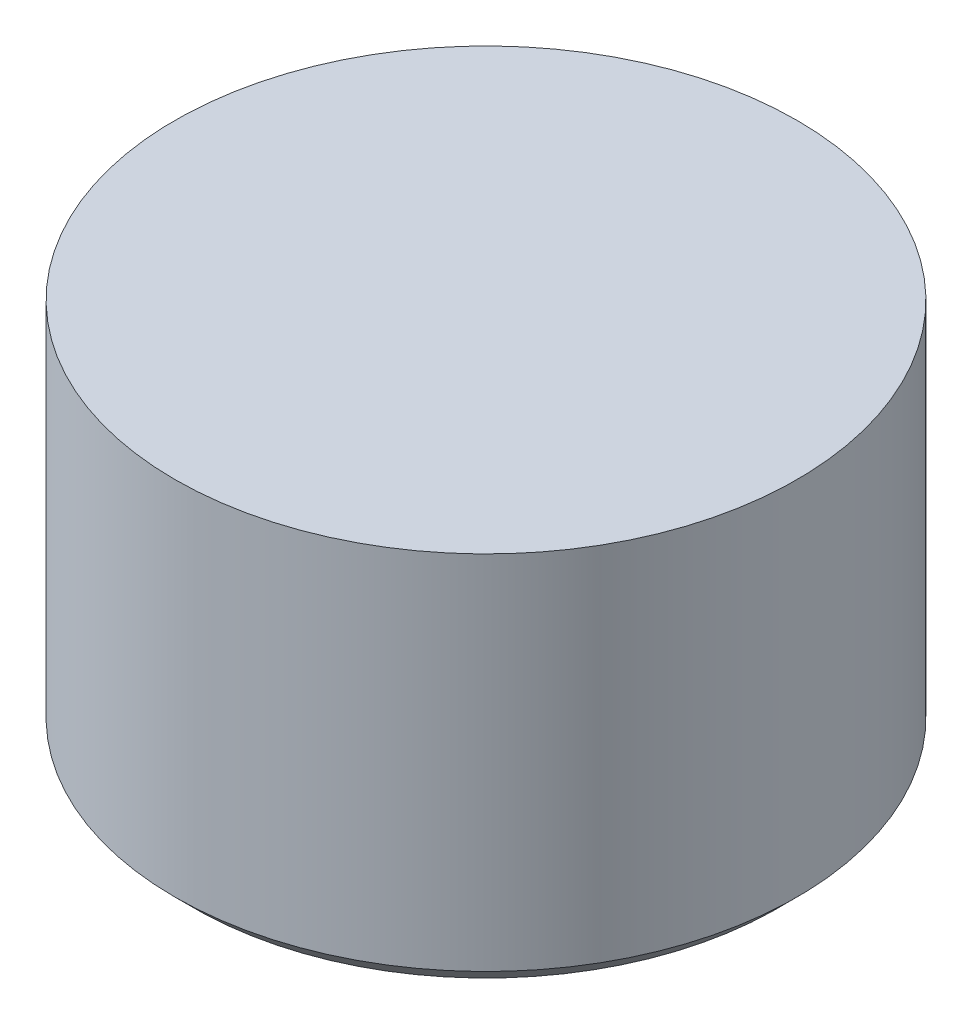
ISO-10303-21;
HEADER;
FILE_DESCRIPTION(('STEP AP214'),'2;1');
FILE_NAME('part.step','',(''),(''),'','','');
FILE_SCHEMA(('AUTOMOTIVE_DESIGN { 1 0 10303 214 1 1 1 1 }'));
ENDSEC;
DATA;
#1=APPLICATION_CONTEXT('core data for automotive mechanical design processes');
#2=APPLICATION_PROTOCOL_DEFINITION('international standard','automotive_design',2000,#1);
#3=PRODUCT_CONTEXT('',#1,'mechanical');
#4=PRODUCT('Part','Part','',(#3));
#5=PRODUCT_RELATED_PRODUCT_CATEGORY('part','',(#4));
#6=PRODUCT_DEFINITION_FORMATION('','',#4);
#7=PRODUCT_DEFINITION_CONTEXT('part definition',#1,'design');
#8=PRODUCT_DEFINITION('design','',#6,#7);
#9=PRODUCT_DEFINITION_SHAPE('','',#8);
#10=(LENGTH_UNIT() NAMED_UNIT(*) SI_UNIT(.MILLI.,.METRE.));
#11=(NAMED_UNIT(*) PLANE_ANGLE_UNIT() SI_UNIT($,.RADIAN.));
#12=(NAMED_UNIT(*) SI_UNIT($,.STERADIAN.) SOLID_ANGLE_UNIT());
#13=UNCERTAINTY_MEASURE_WITH_UNIT(LENGTH_MEASURE(1.E-05),#10,'distance_accuracy_value','');
#14=(GEOMETRIC_REPRESENTATION_CONTEXT(3) GLOBAL_UNCERTAINTY_ASSIGNED_CONTEXT((#13)) GLOBAL_UNIT_ASSIGNED_CONTEXT((#10,
#11,#12)) REPRESENTATION_CONTEXT('',''));
#15=CARTESIAN_POINT('',(0.,0.,0.));
#16=DIRECTION('',(0.,0.,1.));
#17=DIRECTION('',(1.,0.,0.));
#18=AXIS2_PLACEMENT_3D('',#15,#16,#17);
#19=CARTESIAN_POINT('',(-4.92125,-9.238275296126,-7.55));
#20=DIRECTION('',(0.,-1.,0.));
#21=DIRECTION('',(-1.,0.,0.));
#22=AXIS2_PLACEMENT_3D('',#19,#20,#21);
#23=PLANE('',#22);
#24=DIRECTION('',(-0.866025403784439,0.,0.5));
#25=VECTOR('',#24,1.);
#26=CARTESIAN_POINT('',(1.0414,-9.23827529612599,-6.94874742966592));
#27=LINE('',#26,#25);
#28=CARTESIAN_POINT('',(1.0414,-9.23827529612599,-6.94874742966592));
#29=VERTEX_POINT('',#28);
#30=CARTESIAN_POINT('',(0.,-9.238275296126,-6.34749485933185));
#31=VERTEX_POINT('',#30);
#32=EDGE_CURVE('E154',#29,#31,#27,.T.);
#33=ORIENTED_EDGE('',*,*,#32,.T.);
#34=DIRECTION('',(-0.866025403784438,0.,-0.5));
#35=VECTOR('',#34,1.);
#36=CARTESIAN_POINT('',(0.,-9.238275296126,-6.34749485933185));
#37=LINE('',#36,#35);
#38=CARTESIAN_POINT('',(-1.0414,-9.23827529612599,-6.94874742966593));
#39=VERTEX_POINT('',#38);
#40=EDGE_CURVE('E11',#31,#39,#37,.T.);
#41=ORIENTED_EDGE('',*,*,#40,.T.);
#42=DIRECTION('',(0.,0.,-1.));
#43=VECTOR('',#42,1.);
#44=CARTESIAN_POINT('',(-1.0414,-9.23827529612599,-6.94874742966593));
#45=LINE('',#44,#43);
#46=CARTESIAN_POINT('',(-1.0414,-9.238275296126,-8.15125257033408));
#47=VERTEX_POINT('',#46);
#48=EDGE_CURVE('E42',#39,#47,#45,.T.);
#49=ORIENTED_EDGE('',*,*,#48,.T.);
#50=DIRECTION('',(0.866025403784439,0.,-0.5));
#51=VECTOR('',#50,1.);
#52=CARTESIAN_POINT('',(-1.0414,-9.238275296126,-8.15125257033408));
#53=LINE('',#52,#51);
#54=CARTESIAN_POINT('',(0.,-9.238275296126,-8.75250514066815));
#55=VERTEX_POINT('',#54);
#56=EDGE_CURVE('E108',#47,#55,#53,.T.);
#57=ORIENTED_EDGE('',*,*,#56,.T.);
#58=DIRECTION('',(0.866025403784438,0.,0.5));
#59=VECTOR('',#58,1.);
#60=CARTESIAN_POINT('',(0.,-9.238275296126,-8.75250514066815));
#61=LINE('',#60,#59);
#62=CARTESIAN_POINT('',(1.0414,-9.238275296126,-8.15125257033408));
#63=VERTEX_POINT('',#62);
#64=EDGE_CURVE('E164',#55,#63,#61,.T.);
#65=ORIENTED_EDGE('',*,*,#64,.T.);
#66=DIRECTION('',(0.,0.,1.));
#67=VECTOR('',#66,1.);
#68=CARTESIAN_POINT('',(1.0414,-9.238275296126,-8.15125257033408));
#69=LINE('',#68,#67);
#70=EDGE_CURVE('E158',#63,#29,#69,.T.);
#71=ORIENTED_EDGE('',*,*,#70,.T.);
#72=EDGE_LOOP('',(#33,#41,#49,#57,#65,#71));
#73=FACE_BOUND('',#72,.T.);
#74=ADVANCED_FACE('F17',(#73),#23,.T.);
#75=CARTESIAN_POINT('',(0.,-9.238275296126,-6.34749485933185));
#76=DIRECTION('',(-0.5,0.,0.866025403784438));
#77=DIRECTION('',(0.,1.,0.));
#78=AXIS2_PLACEMENT_3D('',#75,#76,#77);
#79=PLANE('',#78);
#80=DIRECTION('',(-0.866025403784438,0.,-0.5));
#81=VECTOR('',#80,1.);
#82=CARTESIAN_POINT('',(0.,-10.203475296126,-6.34749485933185));
#83=LINE('',#82,#81);
#84=CARTESIAN_POINT('',(0.,-10.203475296126,-6.34749485933185));
#85=VERTEX_POINT('',#84);
#86=CARTESIAN_POINT('',(-1.0414,-10.203475296126,-6.94874742966593));
#87=VERTEX_POINT('',#86);
#88=EDGE_CURVE('E119',#85,#87,#83,.T.);
#89=ORIENTED_EDGE('',*,*,#88,.T.);
#90=DIRECTION('',(0.,-1.,0.));
#91=VECTOR('',#90,1.);
#92=CARTESIAN_POINT('',(-1.0414,-9.23827529612599,-6.94874742966593));
#93=LINE('',#92,#91);
#94=EDGE_CURVE('E25',#39,#87,#93,.T.);
#95=ORIENTED_EDGE('',*,*,#94,.F.);
#96=ORIENTED_EDGE('',*,*,#40,.F.);
#97=DIRECTION('',(0.,-1.,0.));
#98=VECTOR('',#97,1.);
#99=CARTESIAN_POINT('',(0.,-9.238275296126,-6.34749485933185));
#100=LINE('',#99,#98);
#101=EDGE_CURVE('E151',#31,#85,#100,.T.);
#102=ORIENTED_EDGE('',*,*,#101,.T.);
#103=EDGE_LOOP('',(#89,#95,#96,#102));
#104=FACE_BOUND('',#103,.T.);
#105=ADVANCED_FACE('F282',(#104),#79,.F.);
#106=CARTESIAN_POINT('',(-1.0414,-9.23827529612599,-6.94874742966593));
#107=DIRECTION('',(-1.,0.,0.));
#108=DIRECTION('',(0.,0.,1.));
#109=AXIS2_PLACEMENT_3D('',#106,#107,#108);
#110=PLANE('',#109);
#111=DIRECTION('',(0.,0.,-1.));
#112=VECTOR('',#111,1.);
#113=CARTESIAN_POINT('',(-1.0414,-10.203475296126,-6.94874742966593));
#114=LINE('',#113,#112);
#115=CARTESIAN_POINT('',(-1.0414,-10.203475296126,-8.15125257033408));
#116=VERTEX_POINT('',#115);
#117=EDGE_CURVE('E113',#87,#116,#114,.T.);
#118=ORIENTED_EDGE('',*,*,#117,.T.);
#119=DIRECTION('',(0.,-1.,0.));
#120=VECTOR('',#119,1.);
#121=CARTESIAN_POINT('',(-1.0414,-9.238275296126,-8.15125257033408));
#122=LINE('',#121,#120);
#123=EDGE_CURVE('E101',#47,#116,#122,.T.);
#124=ORIENTED_EDGE('',*,*,#123,.F.);
#125=ORIENTED_EDGE('',*,*,#48,.F.);
#126=ORIENTED_EDGE('',*,*,#94,.T.);
#127=EDGE_LOOP('',(#118,#124,#125,#126));
#128=FACE_BOUND('',#127,.T.);
#129=ADVANCED_FACE('F114',(#128),#110,.F.);
#130=CARTESIAN_POINT('',(-1.0414,-9.238275296126,-8.15125257033408));
#131=DIRECTION('',(-0.5,0.,-0.866025403784439));
#132=DIRECTION('',(-0.866025403784439,0.,0.5));
#133=AXIS2_PLACEMENT_3D('',#130,#131,#132);
#134=PLANE('',#133);
#135=DIRECTION('',(0.866025403784439,0.,-0.5));
#136=VECTOR('',#135,1.);
#137=CARTESIAN_POINT('',(-1.0414,-10.203475296126,-8.15125257033408));
#138=LINE('',#137,#136);
#139=CARTESIAN_POINT('',(0.,-10.203475296126,-8.75250514066815));
#140=VERTEX_POINT('',#139);
#141=EDGE_CURVE('E106',#116,#140,#138,.T.);
#142=ORIENTED_EDGE('',*,*,#141,.T.);
#143=DIRECTION('',(0.,-1.,0.));
#144=VECTOR('',#143,1.);
#145=CARTESIAN_POINT('',(0.,-9.238275296126,-8.75250514066815));
#146=LINE('',#145,#144);
#147=EDGE_CURVE('E165',#55,#140,#146,.T.);
#148=ORIENTED_EDGE('',*,*,#147,.F.);
#149=ORIENTED_EDGE('',*,*,#56,.F.);
#150=ORIENTED_EDGE('',*,*,#123,.T.);
#151=EDGE_LOOP('',(#142,#148,#149,#150));
#152=FACE_BOUND('',#151,.T.);
#153=ADVANCED_FACE('F103',(#152),#134,.F.);
#154=CARTESIAN_POINT('',(0.,-9.238275296126,-8.75250514066815));
#155=DIRECTION('',(0.5,0.,-0.866025403784438));
#156=DIRECTION('',(0.,-1.,0.));
#157=AXIS2_PLACEMENT_3D('',#154,#155,#156);
#158=PLANE('',#157);
#159=DIRECTION('',(0.866025403784438,0.,0.5));
#160=VECTOR('',#159,1.);
#161=CARTESIAN_POINT('',(0.,-10.203475296126,-8.75250514066815));
#162=LINE('',#161,#160);
#163=CARTESIAN_POINT('',(1.0414,-10.203475296126,-8.15125257033408));
#164=VERTEX_POINT('',#163);
#165=EDGE_CURVE('E126',#140,#164,#162,.T.);
#166=ORIENTED_EDGE('',*,*,#165,.T.);
#167=DIRECTION('',(0.,-1.,0.));
#168=VECTOR('',#167,1.);
#169=CARTESIAN_POINT('',(1.0414,-9.238275296126,-8.15125257033408));
#170=LINE('',#169,#168);
#171=EDGE_CURVE('E161',#63,#164,#170,.T.);
#172=ORIENTED_EDGE('',*,*,#171,.F.);
#173=ORIENTED_EDGE('',*,*,#64,.F.);
#174=ORIENTED_EDGE('',*,*,#147,.T.);
#175=EDGE_LOOP('',(#166,#172,#173,#174));
#176=FACE_BOUND('',#175,.T.);
#177=ADVANCED_FACE('F297',(#176),#158,.F.);
#178=CARTESIAN_POINT('',(1.0414,-9.238275296126,-8.15125257033408));
#179=DIRECTION('',(1.,0.,0.));
#180=DIRECTION('',(0.,0.,1.));
#181=AXIS2_PLACEMENT_3D('',#178,#179,#180);
#182=PLANE('',#181);
#183=DIRECTION('',(0.,0.,1.));
#184=VECTOR('',#183,1.);
#185=CARTESIAN_POINT('',(1.0414,-10.203475296126,-8.15125257033408));
#186=LINE('',#185,#184);
#187=CARTESIAN_POINT('',(1.0414,-10.203475296126,-6.94874742966592));
#188=VERTEX_POINT('',#187);
#189=EDGE_CURVE('E133',#164,#188,#186,.T.);
#190=ORIENTED_EDGE('',*,*,#189,.T.);
#191=DIRECTION('',(0.,-1.,0.));
#192=VECTOR('',#191,1.);
#193=CARTESIAN_POINT('',(1.0414,-9.23827529612599,-6.94874742966592));
#194=LINE('',#193,#192);
#195=EDGE_CURVE('E155',#29,#188,#194,.T.);
#196=ORIENTED_EDGE('',*,*,#195,.F.);
#197=ORIENTED_EDGE('',*,*,#70,.F.);
#198=ORIENTED_EDGE('',*,*,#171,.T.);
#199=EDGE_LOOP('',(#190,#196,#197,#198));
#200=FACE_BOUND('',#199,.T.);
#201=ADVANCED_FACE('F293',(#200),#182,.F.);
#202=CARTESIAN_POINT('',(1.0414,-9.23827529612599,-6.94874742966592));
#203=DIRECTION('',(0.5,0.,0.866025403784439));
#204=DIRECTION('',(0.,-1.,0.));
#205=AXIS2_PLACEMENT_3D('',#202,#203,#204);
#206=PLANE('',#205);
#207=DIRECTION('',(-0.866025403784439,0.,0.5));
#208=VECTOR('',#207,1.);
#209=CARTESIAN_POINT('',(1.0414,-10.203475296126,-6.94874742966592));
#210=LINE('',#209,#208);
#211=EDGE_CURVE('E139',#188,#85,#210,.T.);
#212=ORIENTED_EDGE('',*,*,#211,.T.);
#213=ORIENTED_EDGE('',*,*,#101,.F.);
#214=ORIENTED_EDGE('',*,*,#32,.F.);
#215=ORIENTED_EDGE('',*,*,#195,.T.);
#216=EDGE_LOOP('',(#212,#213,#214,#215));
#217=FACE_BOUND('',#216,.T.);
#218=ADVANCED_FACE('F279',(#217),#206,.F.);
#219=CARTESIAN_POINT('',(0.,-10.203475296126,-7.55));
#220=DIRECTION('',(0.,-1.,0.));
#221=DIRECTION('',(-1.,0.,0.));
#222=AXIS2_PLACEMENT_3D('',#219,#220,#221);
#223=PLANE('',#222);
#224=ORIENTED_EDGE('',*,*,#211,.F.);
#225=ORIENTED_EDGE('',*,*,#189,.F.);
#226=ORIENTED_EDGE('',*,*,#165,.F.);
#227=ORIENTED_EDGE('',*,*,#141,.F.);
#228=ORIENTED_EDGE('',*,*,#117,.F.);
#229=ORIENTED_EDGE('',*,*,#88,.F.);
#230=EDGE_LOOP('',(#224,#225,#226,#227,#228,#229));
#231=FACE_BOUND('',#230,.T.);
#232=CARTESIAN_POINT('',(0.,-10.203475296126,-7.55));
#233=DIRECTION('',(0.,-1.,0.));
#234=DIRECTION('',(0.,0.,-1.));
#235=AXIS2_PLACEMENT_3D('',#232,#233,#234);
#236=CIRCLE('',#235,1.905);
#237=CARTESIAN_POINT('',(0.,-10.203475296126,-9.455));
#238=VERTEX_POINT('',#237);
#239=EDGE_CURVE('E238',#238,#238,#236,.T.);
#240=ORIENTED_EDGE('',*,*,#239,.T.);
#241=EDGE_LOOP('',(#240));
#242=FACE_BOUND('',#241,.T.);
#243=ADVANCED_FACE('F122',(#231,#242),#223,.T.);
#244=CARTESIAN_POINT('',(0.,-7.714275296126,-7.55));
#245=DIRECTION('',(0.,-1.,0.));
#246=DIRECTION('',(-1.,0.,0.));
#247=AXIS2_PLACEMENT_3D('',#244,#245,#246);
#248=PLANE('',#247);
#249=CARTESIAN_POINT('',(0.,-7.714275296126,-7.55));
#250=DIRECTION('',(0.,-1.,0.));
#251=DIRECTION('',(0.,0.,-1.));
#252=AXIS2_PLACEMENT_3D('',#249,#250,#251);
#253=CIRCLE('',#252,2.032);
#254=CARTESIAN_POINT('',(0.,-7.714275296126,-5.518));
#255=VERTEX_POINT('',#254);
#256=EDGE_CURVE('E143',#255,#255,#253,.T.);
#257=ORIENTED_EDGE('',*,*,#256,.F.);
#258=EDGE_LOOP('',(#257));
#259=FACE_BOUND('',#258,.T.);
#260=ADVANCED_FACE('F269',(#259),#248,.F.);
#261=CARTESIAN_POINT('',(0.,-7.714275296126,-7.55));
#262=DIRECTION('',(0.,-1.,0.));
#263=DIRECTION('',(0.,0.,-1.));
#264=AXIS2_PLACEMENT_3D('',#261,#262,#263);
#265=CYLINDRICAL_SURFACE('',#264,2.032);
#266=CARTESIAN_POINT('',(0.,-10.076475296126,-7.55));
#267=DIRECTION('',(0.,1.,0.));
#268=DIRECTION('',(0.,0.,-1.));
#269=AXIS2_PLACEMENT_3D('',#266,#267,#268);
#270=CIRCLE('',#269,2.032);
#271=CARTESIAN_POINT('',(0.,-10.076475296126,-5.518));
#272=VERTEX_POINT('',#271);
#273=CARTESIAN_POINT('',(0.,-10.076475296126,-9.582));
#274=VERTEX_POINT('',#273);
#275=EDGE_CURVE('E254',#272,#274,#270,.T.);
#276=ORIENTED_EDGE('',*,*,#275,.T.);
#277=CARTESIAN_POINT('',(0.,-10.076475296126,-7.55));
#278=DIRECTION('',(0.,1.,0.));
#279=DIRECTION('',(0.,0.,-1.));
#280=AXIS2_PLACEMENT_3D('',#277,#278,#279);
#281=CIRCLE('',#280,2.032);
#282=EDGE_CURVE('E247',#274,#272,#281,.T.);
#283=ORIENTED_EDGE('',*,*,#282,.T.);
#284=DIRECTION('',(0.,1.,0.));
#285=VECTOR('',#284,1.);
#286=CARTESIAN_POINT('',(0.,-7.714275296126,-5.518));
#287=LINE('',#286,#285);
#288=EDGE_CURVE('E137',#272,#255,#287,.T.);
#289=ORIENTED_EDGE('',*,*,#288,.T.);
#290=ORIENTED_EDGE('',*,*,#256,.T.);
#291=ORIENTED_EDGE('',*,*,#288,.F.);
#292=EDGE_LOOP('',(#276,#283,#289,#290,#291));
#293=FACE_BOUND('',#292,.T.);
#294=ADVANCED_FACE('F267',(#293),#265,.T.);
#295=CARTESIAN_POINT('',(0.,-10.203475296126,-7.55));
#296=DIRECTION('',(0.,1.,0.));
#297=DIRECTION('',(0.,0.,1.));
#298=AXIS2_PLACEMENT_3D('',#295,#296,#297);
#299=CONICAL_SURFACE('',#298,1.905,0.785398163397447);
#300=ORIENTED_EDGE('',*,*,#275,.F.);
#301=ORIENTED_EDGE('',*,*,#282,.F.);
#302=DIRECTION('',(0.,-0.707106781186549,0.707106781186546));
#303=VECTOR('',#302,1.);
#304=CARTESIAN_POINT('',(0.,-10.203475296126,-9.455));
#305=LINE('',#304,#303);
#306=EDGE_CURVE('E242',#274,#238,#305,.T.);
#307=ORIENTED_EDGE('',*,*,#306,.T.);
#308=ORIENTED_EDGE('',*,*,#239,.F.);
#309=ORIENTED_EDGE('',*,*,#306,.F.);
#310=EDGE_LOOP('',(#300,#301,#307,#308,#309));
#311=FACE_BOUND('',#310,.T.);
#312=ADVANCED_FACE('F277',(#311),#299,.T.);
#313=CLOSED_SHELL('',(#74,#105,#129,#153,#177,#201,#218,#243,#260,#294,#312));
#314=MANIFOLD_SOLID_BREP('B1',#313);
#315=ADVANCED_BREP_SHAPE_REPRESENTATION('',(#18,#314),#14);
#316=SHAPE_DEFINITION_REPRESENTATION(#9,#315);
ENDSEC;
END-ISO-10303-21;
